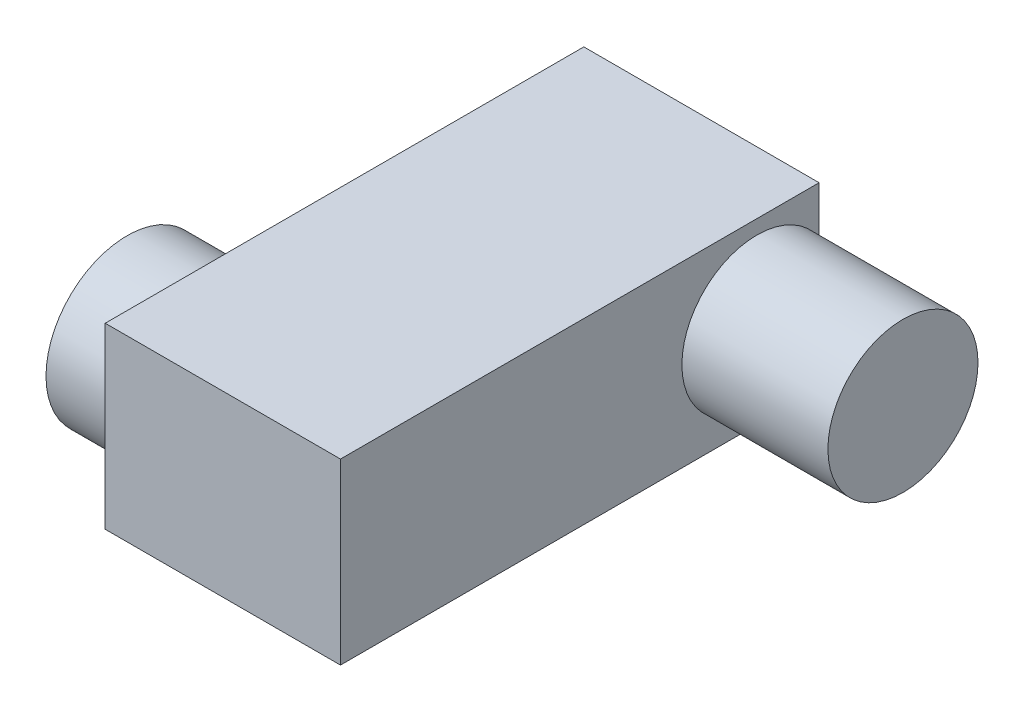
ISO-10303-21;
HEADER;
FILE_DESCRIPTION(('STEP AP214'),'2;1');
FILE_NAME('part.step','',(''),(''),'','','');
FILE_SCHEMA(('AUTOMOTIVE_DESIGN { 1 0 10303 214 1 1 1 1 }'));
ENDSEC;
DATA;
#1=APPLICATION_CONTEXT('core data for automotive mechanical design processes');
#2=APPLICATION_PROTOCOL_DEFINITION('international standard','automotive_design',2000,#1);
#3=PRODUCT_CONTEXT('',#1,'mechanical');
#4=PRODUCT('Part','Part','',(#3));
#5=PRODUCT_RELATED_PRODUCT_CATEGORY('part','',(#4));
#6=PRODUCT_DEFINITION_FORMATION('','',#4);
#7=PRODUCT_DEFINITION_CONTEXT('part definition',#1,'design');
#8=PRODUCT_DEFINITION('design','',#6,#7);
#9=PRODUCT_DEFINITION_SHAPE('','',#8);
#10=(LENGTH_UNIT() NAMED_UNIT(*) SI_UNIT(.MILLI.,.METRE.));
#11=(NAMED_UNIT(*) PLANE_ANGLE_UNIT() SI_UNIT($,.RADIAN.));
#12=(NAMED_UNIT(*) SI_UNIT($,.STERADIAN.) SOLID_ANGLE_UNIT());
#13=UNCERTAINTY_MEASURE_WITH_UNIT(LENGTH_MEASURE(1.E-05),#10,'distance_accuracy_value','');
#14=(GEOMETRIC_REPRESENTATION_CONTEXT(3) GLOBAL_UNCERTAINTY_ASSIGNED_CONTEXT((#13)) GLOBAL_UNIT_ASSIGNED_CONTEXT((#10,
#11,#12)) REPRESENTATION_CONTEXT('',''));
#15=CARTESIAN_POINT('',(0.,0.,0.));
#16=DIRECTION('',(0.,0.,1.));
#17=DIRECTION('',(1.,0.,0.));
#18=AXIS2_PLACEMENT_3D('',#15,#16,#17);
#19=CARTESIAN_POINT('',(0.,22.,0.));
#20=DIRECTION('',(-1.,0.,0.));
#21=DIRECTION('',(0.,0.,1.));
#22=AXIS2_PLACEMENT_3D('',#19,#20,#21);
#23=PLANE('',#22);
#24=CARTESIAN_POINT('',(0.,11.,-51.3375));
#25=DIRECTION('',(1.,0.,0.));
#26=DIRECTION('',(0.,0.,-1.));
#27=AXIS2_PLACEMENT_3D('',#24,#25,#26);
#28=CIRCLE('',#27,9.25);
#29=CARTESIAN_POINT('',(0.,16.181562867514,-59.));
#30=VERTEX_POINT('',#29);
#31=CARTESIAN_POINT('',(0.,5.81843713248599,-59.));
#32=VERTEX_POINT('',#31);
#33=EDGE_CURVE('E47',#30,#32,#28,.T.);
#34=ORIENTED_EDGE('',*,*,#33,.F.);
#35=DIRECTION('',(0.,-1.,0.));
#36=VECTOR('',#35,1.);
#37=CARTESIAN_POINT('',(0.,22.,-59.));
#38=LINE('',#37,#36);
#39=CARTESIAN_POINT('',(0.,22.,-59.));
#40=VERTEX_POINT('',#39);
#41=EDGE_CURVE('E40',#40,#30,#38,.T.);
#42=ORIENTED_EDGE('',*,*,#41,.F.);
#43=DIRECTION('',(0.,0.,-1.));
#44=VECTOR('',#43,1.);
#45=CARTESIAN_POINT('',(0.,22.,0.));
#46=LINE('',#45,#44);
#47=CARTESIAN_POINT('',(0.,22.,0.));
#48=VERTEX_POINT('',#47);
#49=EDGE_CURVE('E110',#48,#40,#46,.T.);
#50=ORIENTED_EDGE('',*,*,#49,.F.);
#51=DIRECTION('',(0.,-1.,0.));
#52=VECTOR('',#51,1.);
#53=CARTESIAN_POINT('',(0.,22.,0.));
#54=LINE('',#53,#52);
#55=CARTESIAN_POINT('',(0.,0.,0.));
#56=VERTEX_POINT('',#55);
#57=EDGE_CURVE('E116',#48,#56,#54,.T.);
#58=ORIENTED_EDGE('',*,*,#57,.T.);
#59=DIRECTION('',(0.,0.,-1.));
#60=VECTOR('',#59,1.);
#61=CARTESIAN_POINT('',(0.,0.,0.));
#62=LINE('',#61,#60);
#63=CARTESIAN_POINT('',(0.,0.,-59.));
#64=VERTEX_POINT('',#63);
#65=EDGE_CURVE('E97',#56,#64,#62,.T.);
#66=ORIENTED_EDGE('',*,*,#65,.T.);
#67=EDGE_CURVE('E90',#32,#64,#38,.T.);
#68=ORIENTED_EDGE('',*,*,#67,.F.);
#69=EDGE_LOOP('',(#34,#42,#50,#58,#66,#68));
#70=FACE_BOUND('',#69,.T.);
#71=ADVANCED_FACE('F33',(#70),#23,.F.);
#72=CARTESIAN_POINT('',(0.,22.,-59.));
#73=DIRECTION('',(0.,0.,1.));
#74=DIRECTION('',(1.,0.,0.));
#75=AXIS2_PLACEMENT_3D('',#72,#73,#74);
#76=PLANE('',#75);
#77=DIRECTION('',(-1.,0.,0.));
#78=VECTOR('',#77,1.);
#79=CARTESIAN_POINT('',(0.,0.,-59.));
#80=LINE('',#79,#78);
#81=CARTESIAN_POINT('',(-29.,0.,-59.));
#82=VERTEX_POINT('',#81);
#83=EDGE_CURVE('E118',#64,#82,#80,.T.);
#84=ORIENTED_EDGE('',*,*,#83,.T.);
#85=DIRECTION('',(0.,-1.,0.));
#86=VECTOR('',#85,1.);
#87=CARTESIAN_POINT('',(-29.,22.,-59.));
#88=LINE('',#87,#86);
#89=CARTESIAN_POINT('',(-29.,22.,-59.));
#90=VERTEX_POINT('',#89);
#91=EDGE_CURVE('E98',#90,#82,#88,.T.);
#92=ORIENTED_EDGE('',*,*,#91,.F.);
#93=DIRECTION('',(-1.,0.,0.));
#94=VECTOR('',#93,1.);
#95=CARTESIAN_POINT('',(0.,22.,-59.));
#96=LINE('',#95,#94);
#97=EDGE_CURVE('E84',#40,#90,#96,.T.);
#98=ORIENTED_EDGE('',*,*,#97,.F.);
#99=ORIENTED_EDGE('',*,*,#41,.T.);
#100=EDGE_CURVE('E88',#30,#32,#38,.T.);
#101=ORIENTED_EDGE('',*,*,#100,.T.);
#102=ORIENTED_EDGE('',*,*,#67,.T.);
#103=EDGE_LOOP('',(#84,#92,#98,#99,#101,#102));
#104=FACE_BOUND('',#103,.T.);
#105=ADVANCED_FACE('F89',(#104),#76,.F.);
#106=CARTESIAN_POINT('',(-29.,22.,0.));
#107=DIRECTION('',(1.,0.,0.));
#108=DIRECTION('',(0.,0.,-1.));
#109=AXIS2_PLACEMENT_3D('',#106,#107,#108);
#110=PLANE('',#109);
#111=CARTESIAN_POINT('',(-29.,11.,-11.7));
#112=DIRECTION('',(1.,0.,0.));
#113=DIRECTION('',(0.,0.,-1.));
#114=AXIS2_PLACEMENT_3D('',#111,#112,#113);
#115=CIRCLE('',#114,10.);
#116=CARTESIAN_POINT('',(-29.,11.,-21.7));
#117=VERTEX_POINT('',#116);
#118=EDGE_CURVE('E11',#117,#117,#115,.F.);
#119=ORIENTED_EDGE('',*,*,#118,.F.);
#120=EDGE_LOOP('',(#119));
#121=FACE_BOUND('',#120,.T.);
#122=DIRECTION('',(0.,0.,1.));
#123=VECTOR('',#122,1.);
#124=CARTESIAN_POINT('',(-29.,0.,0.));
#125=LINE('',#124,#123);
#126=CARTESIAN_POINT('',(-29.,0.,0.));
#127=VERTEX_POINT('',#126);
#128=EDGE_CURVE('E120',#82,#127,#125,.T.);
#129=ORIENTED_EDGE('',*,*,#128,.T.);
#130=DIRECTION('',(0.,-1.,0.));
#131=VECTOR('',#130,1.);
#132=CARTESIAN_POINT('',(-29.,22.,0.));
#133=LINE('',#132,#131);
#134=CARTESIAN_POINT('',(-29.,22.,0.));
#135=VERTEX_POINT('',#134);
#136=EDGE_CURVE('E124',#135,#127,#133,.T.);
#137=ORIENTED_EDGE('',*,*,#136,.F.);
#138=DIRECTION('',(0.,0.,1.));
#139=VECTOR('',#138,1.);
#140=CARTESIAN_POINT('',(-29.,22.,0.));
#141=LINE('',#140,#139);
#142=EDGE_CURVE('E113',#90,#135,#141,.T.);
#143=ORIENTED_EDGE('',*,*,#142,.F.);
#144=ORIENTED_EDGE('',*,*,#91,.T.);
#145=EDGE_LOOP('',(#129,#137,#143,#144));
#146=FACE_BOUND('',#145,.T.);
#147=ADVANCED_FACE('F130',(#121,#146),#110,.F.);
#148=CARTESIAN_POINT('',(0.,22.,0.));
#149=DIRECTION('',(0.,0.,-1.));
#150=DIRECTION('',(-1.,0.,0.));
#151=AXIS2_PLACEMENT_3D('',#148,#149,#150);
#152=PLANE('',#151);
#153=DIRECTION('',(1.,0.,0.));
#154=VECTOR('',#153,1.);
#155=CARTESIAN_POINT('',(0.,0.,0.));
#156=LINE('',#155,#154);
#157=EDGE_CURVE('E77',#127,#56,#156,.T.);
#158=ORIENTED_EDGE('',*,*,#157,.T.);
#159=ORIENTED_EDGE('',*,*,#57,.F.);
#160=DIRECTION('',(1.,0.,0.));
#161=VECTOR('',#160,1.);
#162=CARTESIAN_POINT('',(0.,22.,0.));
#163=LINE('',#162,#161);
#164=EDGE_CURVE('E56',#135,#48,#163,.T.);
#165=ORIENTED_EDGE('',*,*,#164,.F.);
#166=ORIENTED_EDGE('',*,*,#136,.T.);
#167=EDGE_LOOP('',(#158,#159,#165,#166));
#168=FACE_BOUND('',#167,.T.);
#169=ADVANCED_FACE('F144',(#168),#152,.F.);
#170=CARTESIAN_POINT('',(0.,22.,0.));
#171=DIRECTION('',(0.,1.,0.));
#172=DIRECTION('',(0.,0.,1.));
#173=AXIS2_PLACEMENT_3D('',#170,#171,#172);
#174=PLANE('',#173);
#175=ORIENTED_EDGE('',*,*,#49,.T.);
#176=ORIENTED_EDGE('',*,*,#97,.T.);
#177=ORIENTED_EDGE('',*,*,#142,.T.);
#178=ORIENTED_EDGE('',*,*,#164,.T.);
#179=EDGE_LOOP('',(#175,#176,#177,#178));
#180=FACE_BOUND('',#179,.T.);
#181=ADVANCED_FACE('F135',(#180),#174,.T.);
#182=CARTESIAN_POINT('',(0.,0.,0.));
#183=DIRECTION('',(0.,1.,0.));
#184=DIRECTION('',(0.,0.,1.));
#185=AXIS2_PLACEMENT_3D('',#182,#183,#184);
#186=PLANE('',#185);
#187=ORIENTED_EDGE('',*,*,#65,.F.);
#188=ORIENTED_EDGE('',*,*,#157,.F.);
#189=ORIENTED_EDGE('',*,*,#128,.F.);
#190=ORIENTED_EDGE('',*,*,#83,.F.);
#191=EDGE_LOOP('',(#187,#188,#189,#190));
#192=FACE_BOUND('',#191,.T.);
#193=ADVANCED_FACE('F133',(#192),#186,.F.);
#194=CARTESIAN_POINT('',(18.,11.,-51.3375));
#195=DIRECTION('',(-1.,0.,0.));
#196=DIRECTION('',(0.,0.,1.));
#197=AXIS2_PLACEMENT_3D('',#194,#195,#196);
#198=CYLINDRICAL_SURFACE('',#197,9.25);
#199=CARTESIAN_POINT('',(18.,11.,-51.3375));
#200=DIRECTION('',(1.,0.,0.));
#201=DIRECTION('',(0.,0.,-1.));
#202=AXIS2_PLACEMENT_3D('',#199,#200,#201);
#203=CIRCLE('',#202,9.25);
#204=CARTESIAN_POINT('',(18.,11.,-60.5875));
#205=VERTEX_POINT('',#204);
#206=EDGE_CURVE('E105',#205,#205,#203,.T.);
#207=ORIENTED_EDGE('',*,*,#206,.F.);
#208=EDGE_LOOP('',(#207));
#209=FACE_BOUND('',#208,.T.);
#210=ORIENTED_EDGE('',*,*,#33,.T.);
#211=EDGE_CURVE('E99',#32,#30,#28,.T.);
#212=ORIENTED_EDGE('',*,*,#211,.T.);
#213=EDGE_LOOP('',(#210,#212));
#214=FACE_BOUND('',#213,.T.);
#215=ADVANCED_FACE('F104',(#209,#214),#198,.T.);
#216=CARTESIAN_POINT('',(18.,11.,-51.3375));
#217=DIRECTION('',(1.,0.,0.));
#218=DIRECTION('',(0.,0.,-1.));
#219=AXIS2_PLACEMENT_3D('',#216,#217,#218);
#220=PLANE('',#219);
#221=ORIENTED_EDGE('',*,*,#206,.T.);
#222=EDGE_LOOP('',(#221));
#223=FACE_BOUND('',#222,.T.);
#224=ADVANCED_FACE('F141',(#223),#220,.T.);
#225=CARTESIAN_POINT('',(0.,11.,-51.3375));
#226=DIRECTION('',(1.,0.,0.));
#227=DIRECTION('',(0.,0.,-1.));
#228=AXIS2_PLACEMENT_3D('',#225,#226,#227);
#229=PLANE('',#228);
#230=ORIENTED_EDGE('',*,*,#100,.F.);
#231=ORIENTED_EDGE('',*,*,#211,.F.);
#232=EDGE_LOOP('',(#230,#231));
#233=FACE_BOUND('',#232,.T.);
#234=ADVANCED_FACE('F100',(#233),#229,.F.);
#235=CARTESIAN_POINT('',(-38.,11.,-11.7));
#236=DIRECTION('',(1.,0.,0.));
#237=DIRECTION('',(0.,0.,-1.));
#238=AXIS2_PLACEMENT_3D('',#235,#236,#237);
#239=CYLINDRICAL_SURFACE('',#238,10.);
#240=CARTESIAN_POINT('',(-38.,11.,-11.7));
#241=DIRECTION('',(-1.,0.,0.));
#242=DIRECTION('',(0.,0.,1.));
#243=AXIS2_PLACEMENT_3D('',#240,#241,#242);
#244=CIRCLE('',#243,10.);
#245=CARTESIAN_POINT('',(-38.,11.,-1.69999999999999));
#246=VERTEX_POINT('',#245);
#247=EDGE_CURVE('E102',#246,#246,#244,.T.);
#248=ORIENTED_EDGE('',*,*,#247,.F.);
#249=EDGE_LOOP('',(#248));
#250=FACE_BOUND('',#249,.T.);
#251=ORIENTED_EDGE('',*,*,#118,.T.);
#252=EDGE_LOOP('',(#251));
#253=FACE_BOUND('',#252,.T.);
#254=ADVANCED_FACE('F201',(#250,#253),#239,.T.);
#255=CARTESIAN_POINT('',(-38.,11.,-11.7));
#256=DIRECTION('',(-1.,0.,0.));
#257=DIRECTION('',(0.,0.,1.));
#258=AXIS2_PLACEMENT_3D('',#255,#256,#257);
#259=PLANE('',#258);
#260=ORIENTED_EDGE('',*,*,#247,.T.);
#261=EDGE_LOOP('',(#260));
#262=FACE_BOUND('',#261,.T.);
#263=ADVANCED_FACE('F214',(#262),#259,.T.);
#264=CLOSED_SHELL('',(#71,#105,#147,#169,#181,#193,#215,#224,#234,#254,#263));
#265=MANIFOLD_SOLID_BREP('B2',#264);
#266=ADVANCED_BREP_SHAPE_REPRESENTATION('',(#18,#265),#14);
#267=SHAPE_DEFINITION_REPRESENTATION(#9,#266);
ENDSEC;
END-ISO-10303-21;
